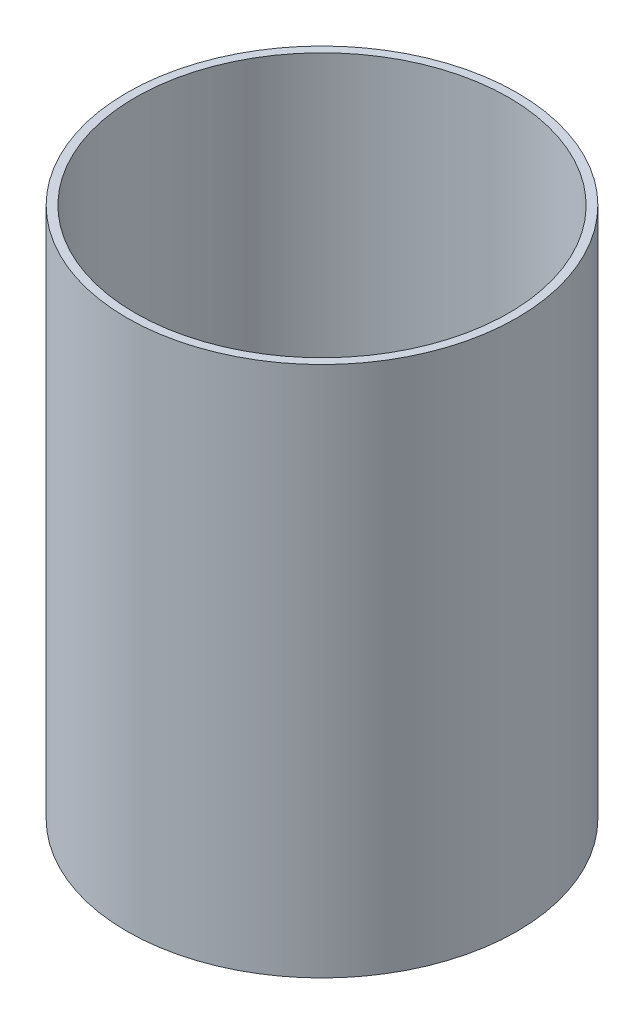
ISO-10303-21;
HEADER;
FILE_DESCRIPTION(('STEP AP214'),'2;1');
FILE_NAME('part.step','',(''),(''),'','','');
FILE_SCHEMA(('AUTOMOTIVE_DESIGN { 1 0 10303 214 1 1 1 1 }'));
ENDSEC;
DATA;
#1=APPLICATION_CONTEXT('core data for automotive mechanical design processes');
#2=APPLICATION_PROTOCOL_DEFINITION('international standard','automotive_design',2000,#1);
#3=PRODUCT_CONTEXT('',#1,'mechanical');
#4=PRODUCT('Part','Part','',(#3));
#5=PRODUCT_RELATED_PRODUCT_CATEGORY('part','',(#4));
#6=PRODUCT_DEFINITION_FORMATION('','',#4);
#7=PRODUCT_DEFINITION_CONTEXT('part definition',#1,'design');
#8=PRODUCT_DEFINITION('design','',#6,#7);
#9=PRODUCT_DEFINITION_SHAPE('','',#8);
#10=(LENGTH_UNIT() NAMED_UNIT(*) SI_UNIT(.MILLI.,.METRE.));
#11=(NAMED_UNIT(*) PLANE_ANGLE_UNIT() SI_UNIT($,.RADIAN.));
#12=(NAMED_UNIT(*) SI_UNIT($,.STERADIAN.) SOLID_ANGLE_UNIT());
#13=UNCERTAINTY_MEASURE_WITH_UNIT(LENGTH_MEASURE(1.E-05),#10,'distance_accuracy_value','');
#14=(GEOMETRIC_REPRESENTATION_CONTEXT(3) GLOBAL_UNCERTAINTY_ASSIGNED_CONTEXT((#13)) GLOBAL_UNIT_ASSIGNED_CONTEXT((#10,
#11,#12)) REPRESENTATION_CONTEXT('',''));
#15=CARTESIAN_POINT('',(0.,0.,0.));
#16=DIRECTION('',(0.,0.,1.));
#17=DIRECTION('',(1.,0.,0.));
#18=AXIS2_PLACEMENT_3D('',#15,#16,#17);
#19=CARTESIAN_POINT('',(0.,406.4,0.));
#20=DIRECTION('',(0.,1.,0.));
#21=DIRECTION('',(0.,0.,1.));
#22=AXIS2_PLACEMENT_3D('',#19,#20,#21);
#23=PLANE('',#22);
#24=CARTESIAN_POINT('',(0.,406.4,0.));
#25=DIRECTION('',(0.,1.,0.));
#26=DIRECTION('',(0.,0.,1.));
#27=AXIS2_PLACEMENT_3D('',#24,#25,#26);
#28=CIRCLE('',#27,149.225);
#29=CARTESIAN_POINT('',(0.,406.4,149.225));
#30=VERTEX_POINT('',#29);
#31=EDGE_CURVE('E10',#30,#30,#28,.T.);
#32=ORIENTED_EDGE('',*,*,#31,.T.);
#33=EDGE_LOOP('',(#32));
#34=FACE_BOUND('',#33,.T.);
#35=CARTESIAN_POINT('',(0.,406.4,0.));
#36=DIRECTION('',(0.,1.,0.));
#37=DIRECTION('',(0.,0.,1.));
#38=AXIS2_PLACEMENT_3D('',#35,#36,#37);
#39=CIRCLE('',#38,142.875);
#40=CARTESIAN_POINT('',(0.,406.4,142.875));
#41=VERTEX_POINT('',#40);
#42=EDGE_CURVE('E42',#41,#41,#39,.T.);
#43=ORIENTED_EDGE('',*,*,#42,.F.);
#44=EDGE_LOOP('',(#43));
#45=FACE_BOUND('',#44,.T.);
#46=ADVANCED_FACE('F31',(#34,#45),#23,.T.);
#47=CARTESIAN_POINT('',(0.,0.,0.));
#48=DIRECTION('',(0.,1.,0.));
#49=DIRECTION('',(0.,0.,1.));
#50=AXIS2_PLACEMENT_3D('',#47,#48,#49);
#51=PLANE('',#50);
#52=CARTESIAN_POINT('',(0.,0.,0.));
#53=DIRECTION('',(0.,1.,0.));
#54=DIRECTION('',(0.,0.,1.));
#55=AXIS2_PLACEMENT_3D('',#52,#53,#54);
#56=CIRCLE('',#55,149.225);
#57=CARTESIAN_POINT('',(0.,0.,149.225));
#58=VERTEX_POINT('',#57);
#59=EDGE_CURVE('E35',#58,#58,#56,.T.);
#60=ORIENTED_EDGE('',*,*,#59,.F.);
#61=EDGE_LOOP('',(#60));
#62=FACE_BOUND('',#61,.T.);
#63=CARTESIAN_POINT('',(0.,0.,0.));
#64=DIRECTION('',(0.,1.,0.));
#65=DIRECTION('',(0.,0.,1.));
#66=AXIS2_PLACEMENT_3D('',#63,#64,#65);
#67=CIRCLE('',#66,142.875);
#68=CARTESIAN_POINT('',(0.,0.,142.875));
#69=VERTEX_POINT('',#68);
#70=EDGE_CURVE('E44',#69,#69,#67,.T.);
#71=ORIENTED_EDGE('',*,*,#70,.T.);
#72=EDGE_LOOP('',(#71));
#73=FACE_BOUND('',#72,.T.);
#74=ADVANCED_FACE('F54',(#62,#73),#51,.F.);
#75=CARTESIAN_POINT('',(0.,406.4,0.));
#76=DIRECTION('',(0.,-1.,0.));
#77=DIRECTION('',(0.,0.,-1.));
#78=AXIS2_PLACEMENT_3D('',#75,#76,#77);
#79=CYLINDRICAL_SURFACE('',#78,149.225);
#80=ORIENTED_EDGE('',*,*,#31,.F.);
#81=EDGE_LOOP('',(#80));
#82=FACE_BOUND('',#81,.T.);
#83=ORIENTED_EDGE('',*,*,#59,.T.);
#84=EDGE_LOOP('',(#83));
#85=FACE_BOUND('',#84,.T.);
#86=ADVANCED_FACE('F33',(#82,#85),#79,.T.);
#87=CARTESIAN_POINT('',(0.,406.4,0.));
#88=DIRECTION('',(0.,-1.,0.));
#89=DIRECTION('',(0.,0.,-1.));
#90=AXIS2_PLACEMENT_3D('',#87,#88,#89);
#91=CYLINDRICAL_SURFACE('',#90,142.875);
#92=ORIENTED_EDGE('',*,*,#42,.T.);
#93=EDGE_LOOP('',(#92));
#94=FACE_BOUND('',#93,.T.);
#95=ORIENTED_EDGE('',*,*,#70,.F.);
#96=EDGE_LOOP('',(#95));
#97=FACE_BOUND('',#96,.T.);
#98=ADVANCED_FACE('F50',(#94,#97),#91,.F.);
#99=CLOSED_SHELL('',(#46,#74,#86,#98));
#100=MANIFOLD_SOLID_BREP('B2',#99);
#101=ADVANCED_BREP_SHAPE_REPRESENTATION('',(#18,#100),#14);
#102=SHAPE_DEFINITION_REPRESENTATION(#9,#101);
ENDSEC;
END-ISO-10303-21;
